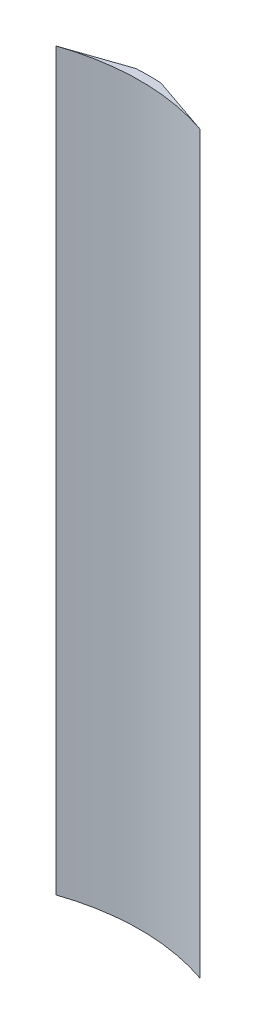
ISO-10303-21;
HEADER;
FILE_DESCRIPTION(('STEP AP214'),'2;1');
FILE_NAME('part.step','',(''),(''),'','','');
FILE_SCHEMA(('AUTOMOTIVE_DESIGN { 1 0 10303 214 1 1 1 1 }'));
ENDSEC;
DATA;
#1=APPLICATION_CONTEXT('core data for automotive mechanical design processes');
#2=APPLICATION_PROTOCOL_DEFINITION('international standard','automotive_design',2000,#1);
#3=PRODUCT_CONTEXT('',#1,'mechanical');
#4=PRODUCT('Part','Part','',(#3));
#5=PRODUCT_RELATED_PRODUCT_CATEGORY('part','',(#4));
#6=PRODUCT_DEFINITION_FORMATION('','',#4);
#7=PRODUCT_DEFINITION_CONTEXT('part definition',#1,'design');
#8=PRODUCT_DEFINITION('design','',#6,#7);
#9=PRODUCT_DEFINITION_SHAPE('','',#8);
#10=(LENGTH_UNIT() NAMED_UNIT(*) SI_UNIT(.MILLI.,.METRE.));
#11=(NAMED_UNIT(*) PLANE_ANGLE_UNIT() SI_UNIT($,.RADIAN.));
#12=(NAMED_UNIT(*) SI_UNIT($,.STERADIAN.) SOLID_ANGLE_UNIT());
#13=UNCERTAINTY_MEASURE_WITH_UNIT(LENGTH_MEASURE(1.E-05),#10,'distance_accuracy_value','');
#14=(GEOMETRIC_REPRESENTATION_CONTEXT(3) GLOBAL_UNCERTAINTY_ASSIGNED_CONTEXT((#13)) GLOBAL_UNIT_ASSIGNED_CONTEXT((#10,
#11,#12)) REPRESENTATION_CONTEXT('',''));
#15=CARTESIAN_POINT('',(0.,0.,0.));
#16=DIRECTION('',(0.,0.,1.));
#17=DIRECTION('',(1.,0.,0.));
#18=AXIS2_PLACEMENT_3D('',#15,#16,#17);
#19=CARTESIAN_POINT('',(0.,133.35,0.));
#20=DIRECTION('',(0.,-1.,0.));
#21=DIRECTION('',(0.,0.,-1.));
#22=AXIS2_PLACEMENT_3D('',#19,#20,#21);
#23=CYLINDRICAL_SURFACE('',#22,40.132);
#24=CARTESIAN_POINT('',(0.,0.,0.));
#25=DIRECTION('',(0.,-1.,0.));
#26=DIRECTION('',(0.,0.,1.));
#27=AXIS2_PLACEMENT_3D('',#24,#25,#26);
#28=CIRCLE('',#27,40.132);
#29=CARTESIAN_POINT('',(-13.0365646255757,0.,-37.9555714851349));
#30=VERTEX_POINT('',#29);
#31=CARTESIAN_POINT('',(13.0385134257351,0.,-37.9549020766347));
#32=VERTEX_POINT('',#31);
#33=EDGE_CURVE('E96',#30,#32,#28,.T.);
#34=ORIENTED_EDGE('',*,*,#33,.T.);
#35=DIRECTION('',(0.,-1.,0.));
#36=VECTOR('',#35,1.);
#37=CARTESIAN_POINT('',(13.0385134257351,133.35,-37.9549020766347));
#38=LINE('',#37,#36);
#39=CARTESIAN_POINT('',(13.0385134257351,133.35,-37.9549020766347));
#40=VERTEX_POINT('',#39);
#41=EDGE_CURVE('E11',#40,#32,#38,.T.);
#42=ORIENTED_EDGE('',*,*,#41,.F.);
#43=CARTESIAN_POINT('',(0.,133.35,0.));
#44=DIRECTION('',(0.,-1.,0.));
#45=DIRECTION('',(0.,0.,1.));
#46=AXIS2_PLACEMENT_3D('',#43,#44,#45);
#47=CIRCLE('',#46,40.132);
#48=CARTESIAN_POINT('',(-13.0365646255757,133.35,-37.9555714851349));
#49=VERTEX_POINT('',#48);
#50=EDGE_CURVE('E84',#49,#40,#47,.T.);
#51=ORIENTED_EDGE('',*,*,#50,.F.);
#52=DIRECTION('',(0.,-1.,0.));
#53=VECTOR('',#52,1.);
#54=CARTESIAN_POINT('',(-13.0365646255757,133.35,-37.9555714851349));
#55=LINE('',#54,#53);
#56=EDGE_CURVE('E92',#49,#30,#55,.T.);
#57=ORIENTED_EDGE('',*,*,#56,.T.);
#58=EDGE_LOOP('',(#34,#42,#51,#57));
#59=FACE_BOUND('',#58,.T.);
#60=ADVANCED_FACE('F33',(#59),#23,.F.);
#61=CARTESIAN_POINT('',(2.257806,133.35,-41.6583604132035));
#62=DIRECTION('',(-0.324890696345435,0.,0.945751571729161));
#63=DIRECTION('',(0.945751571729161,0.,0.324890696345435));
#64=AXIS2_PLACEMENT_3D('',#61,#62,#63);
#65=PLANE('',#64);
#66=DIRECTION('',(-0.945751571729161,0.,-0.324890696345435));
#67=VECTOR('',#66,1.);
#68=CARTESIAN_POINT('',(2.257806,0.,-41.6583604132035));
#69=LINE('',#68,#67);
#70=CARTESIAN_POINT('',(2.25780599999999,0.,-41.6583604132035));
#71=VERTEX_POINT('',#70);
#72=EDGE_CURVE('E88',#32,#71,#69,.T.);
#73=ORIENTED_EDGE('',*,*,#72,.T.);
#74=DIRECTION('',(0.,-1.,0.));
#75=VECTOR('',#74,1.);
#76=CARTESIAN_POINT('',(2.25780599999999,133.35,-41.6583604132035));
#77=LINE('',#76,#75);
#78=CARTESIAN_POINT('',(2.25780599999999,133.35,-41.6583604132035));
#79=VERTEX_POINT('',#78);
#80=EDGE_CURVE('E41',#79,#71,#77,.T.);
#81=ORIENTED_EDGE('',*,*,#80,.F.);
#82=DIRECTION('',(-0.945751571729161,0.,-0.324890696345435));
#83=VECTOR('',#82,1.);
#84=CARTESIAN_POINT('',(2.257806,133.35,-41.6583604132035));
#85=LINE('',#84,#83);
#86=EDGE_CURVE('E79',#40,#79,#85,.T.);
#87=ORIENTED_EDGE('',*,*,#86,.F.);
#88=ORIENTED_EDGE('',*,*,#41,.T.);
#89=EDGE_LOOP('',(#73,#81,#87,#88));
#90=FACE_BOUND('',#89,.T.);
#91=ADVANCED_FACE('F87',(#90),#65,.F.);
#92=CARTESIAN_POINT('',(0.,133.35,0.));
#93=DIRECTION('',(0.,-1.,0.));
#94=DIRECTION('',(0.,0.,-1.));
#95=AXIS2_PLACEMENT_3D('',#92,#93,#94);
#96=CYLINDRICAL_SURFACE('',#95,41.7195);
#97=CARTESIAN_POINT('',(0.,0.,0.));
#98=DIRECTION('',(0.,1.,0.));
#99=DIRECTION('',(0.,0.,1.));
#100=AXIS2_PLACEMENT_3D('',#97,#98,#99);
#101=CIRCLE('',#100,41.7195);
#102=CARTESIAN_POINT('',(-2.25566706110249,0.,-41.6584762846585));
#103=VERTEX_POINT('',#102);
#104=EDGE_CURVE('E66',#71,#103,#101,.T.);
#105=ORIENTED_EDGE('',*,*,#104,.T.);
#106=DIRECTION('',(0.,-1.,0.));
#107=VECTOR('',#106,1.);
#108=CARTESIAN_POINT('',(-2.25566706110249,133.35,-41.6584762846585));
#109=LINE('',#108,#107);
#110=CARTESIAN_POINT('',(-2.25566706110249,133.35,-41.6584762846585));
#111=VERTEX_POINT('',#110);
#112=EDGE_CURVE('E89',#111,#103,#109,.T.);
#113=ORIENTED_EDGE('',*,*,#112,.F.);
#114=CARTESIAN_POINT('',(0.,133.35,0.));
#115=DIRECTION('',(0.,1.,0.));
#116=DIRECTION('',(0.,0.,1.));
#117=AXIS2_PLACEMENT_3D('',#114,#115,#116);
#118=CIRCLE('',#117,41.7195);
#119=EDGE_CURVE('E82',#79,#111,#118,.T.);
#120=ORIENTED_EDGE('',*,*,#119,.F.);
#121=ORIENTED_EDGE('',*,*,#80,.T.);
#122=EDGE_LOOP('',(#105,#113,#120,#121));
#123=FACE_BOUND('',#122,.T.);
#124=ADVANCED_FACE('F90',(#123),#96,.T.);
#125=CARTESIAN_POINT('',(-2.25566706110249,133.35,-41.6584762846585));
#126=DIRECTION('',(0.324842136588652,0.,0.945768251897112));
#127=DIRECTION('',(0.945768251897112,0.,-0.324842136588652));
#128=AXIS2_PLACEMENT_3D('',#125,#126,#127);
#129=PLANE('',#128);
#130=DIRECTION('',(-0.945768251897112,0.,0.324842136588652));
#131=VECTOR('',#130,1.);
#132=CARTESIAN_POINT('',(-2.25566706110249,0.,-41.6584762846585));
#133=LINE('',#132,#131);
#134=EDGE_CURVE('E72',#103,#30,#133,.T.);
#135=ORIENTED_EDGE('',*,*,#134,.T.);
#136=ORIENTED_EDGE('',*,*,#56,.F.);
#137=DIRECTION('',(-0.945768251897112,0.,0.324842136588652));
#138=VECTOR('',#137,1.);
#139=CARTESIAN_POINT('',(-2.25566706110249,133.35,-41.6584762846585));
#140=LINE('',#139,#138);
#141=EDGE_CURVE('E49',#111,#49,#140,.T.);
#142=ORIENTED_EDGE('',*,*,#141,.F.);
#143=ORIENTED_EDGE('',*,*,#112,.T.);
#144=EDGE_LOOP('',(#135,#136,#142,#143));
#145=FACE_BOUND('',#144,.T.);
#146=ADVANCED_FACE('F103',(#145),#129,.F.);
#147=CARTESIAN_POINT('',(0.,133.35,0.));
#148=DIRECTION('',(0.,1.,0.));
#149=DIRECTION('',(0.,0.,1.));
#150=AXIS2_PLACEMENT_3D('',#147,#148,#149);
#151=PLANE('',#150);
#152=ORIENTED_EDGE('',*,*,#50,.T.);
#153=ORIENTED_EDGE('',*,*,#86,.T.);
#154=ORIENTED_EDGE('',*,*,#119,.T.);
#155=ORIENTED_EDGE('',*,*,#141,.T.);
#156=EDGE_LOOP('',(#152,#153,#154,#155));
#157=FACE_BOUND('',#156,.T.);
#158=ADVANCED_FACE('F80',(#157),#151,.T.);
#159=CARTESIAN_POINT('',(0.,0.,0.));
#160=DIRECTION('',(0.,1.,0.));
#161=DIRECTION('',(0.,0.,1.));
#162=AXIS2_PLACEMENT_3D('',#159,#160,#161);
#163=PLANE('',#162);
#164=ORIENTED_EDGE('',*,*,#33,.F.);
#165=ORIENTED_EDGE('',*,*,#134,.F.);
#166=ORIENTED_EDGE('',*,*,#104,.F.);
#167=ORIENTED_EDGE('',*,*,#72,.F.);
#168=EDGE_LOOP('',(#164,#165,#166,#167));
#169=FACE_BOUND('',#168,.T.);
#170=ADVANCED_FACE('F106',(#169),#163,.F.);
#171=CLOSED_SHELL('',(#60,#91,#124,#146,#158,#170));
#172=MANIFOLD_SOLID_BREP('B2',#171);
#173=ADVANCED_BREP_SHAPE_REPRESENTATION('',(#18,#172),#14);
#174=SHAPE_DEFINITION_REPRESENTATION(#9,#173);
ENDSEC;
END-ISO-10303-21;
